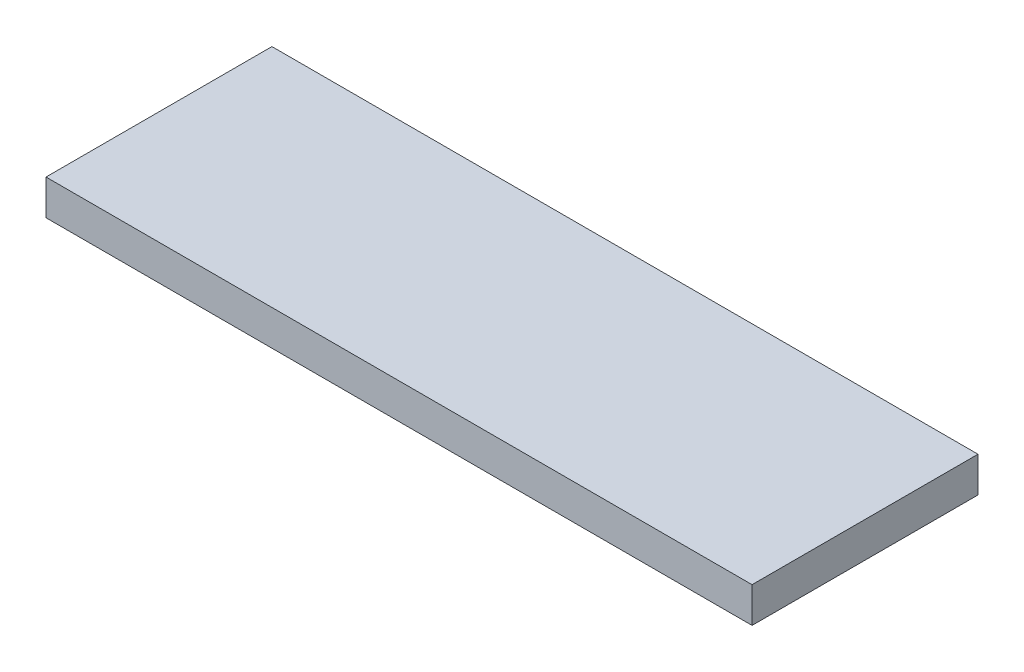
ISO-10303-21;
HEADER;
FILE_DESCRIPTION(('STEP AP214'),'2;1');
FILE_NAME('part.step','',(''),(''),'','','');
FILE_SCHEMA(('AUTOMOTIVE_DESIGN { 1 0 10303 214 1 1 1 1 }'));
ENDSEC;
DATA;
#1=APPLICATION_CONTEXT('core data for automotive mechanical design processes');
#2=APPLICATION_PROTOCOL_DEFINITION('international standard','automotive_design',2000,#1);
#3=PRODUCT_CONTEXT('',#1,'mechanical');
#4=PRODUCT('Part','Part','',(#3));
#5=PRODUCT_RELATED_PRODUCT_CATEGORY('part','',(#4));
#6=PRODUCT_DEFINITION_FORMATION('','',#4);
#7=PRODUCT_DEFINITION_CONTEXT('part definition',#1,'design');
#8=PRODUCT_DEFINITION('design','',#6,#7);
#9=PRODUCT_DEFINITION_SHAPE('','',#8);
#10=(LENGTH_UNIT() NAMED_UNIT(*) SI_UNIT(.MILLI.,.METRE.));
#11=(NAMED_UNIT(*) PLANE_ANGLE_UNIT() SI_UNIT($,.RADIAN.));
#12=(NAMED_UNIT(*) SI_UNIT($,.STERADIAN.) SOLID_ANGLE_UNIT());
#13=UNCERTAINTY_MEASURE_WITH_UNIT(LENGTH_MEASURE(1.E-05),#10,'distance_accuracy_value','');
#14=(GEOMETRIC_REPRESENTATION_CONTEXT(3) GLOBAL_UNCERTAINTY_ASSIGNED_CONTEXT((#13)) GLOBAL_UNIT_ASSIGNED_CONTEXT((#10,
#11,#12)) REPRESENTATION_CONTEXT('',''));
#15=CARTESIAN_POINT('',(0.,0.,0.));
#16=DIRECTION('',(0.,0.,1.));
#17=DIRECTION('',(1.,0.,0.));
#18=AXIS2_PLACEMENT_3D('',#15,#16,#17);
#19=CARTESIAN_POINT('',(50.,5.,16.));
#20=DIRECTION('',(-1.,0.,0.));
#21=DIRECTION('',(0.,0.,1.));
#22=AXIS2_PLACEMENT_3D('',#19,#20,#21);
#23=PLANE('',#22);
#24=DIRECTION('',(0.,0.,-1.));
#25=VECTOR('',#24,1.);
#26=CARTESIAN_POINT('',(50.,0.,16.));
#27=LINE('',#26,#25);
#28=CARTESIAN_POINT('',(50.,0.,16.));
#29=VERTEX_POINT('',#28);
#30=CARTESIAN_POINT('',(50.,0.,-16.));
#31=VERTEX_POINT('',#30);
#32=EDGE_CURVE('E111',#29,#31,#27,.T.);
#33=ORIENTED_EDGE('',*,*,#32,.T.);
#34=DIRECTION('',(0.,-1.,0.));
#35=VECTOR('',#34,1.);
#36=CARTESIAN_POINT('',(50.,5.,-16.));
#37=LINE('',#36,#35);
#38=CARTESIAN_POINT('',(50.,5.,-16.));
#39=VERTEX_POINT('',#38);
#40=EDGE_CURVE('E11',#39,#31,#37,.T.);
#41=ORIENTED_EDGE('',*,*,#40,.F.);
#42=DIRECTION('',(0.,0.,-1.));
#43=VECTOR('',#42,1.);
#44=CARTESIAN_POINT('',(50.,5.,16.));
#45=LINE('',#44,#43);
#46=CARTESIAN_POINT('',(50.,5.,16.));
#47=VERTEX_POINT('',#46);
#48=EDGE_CURVE('E95',#47,#39,#45,.T.);
#49=ORIENTED_EDGE('',*,*,#48,.F.);
#50=DIRECTION('',(0.,-1.,0.));
#51=VECTOR('',#50,1.);
#52=CARTESIAN_POINT('',(50.,5.,16.));
#53=LINE('',#52,#51);
#54=EDGE_CURVE('E107',#47,#29,#53,.T.);
#55=ORIENTED_EDGE('',*,*,#54,.T.);
#56=EDGE_LOOP('',(#33,#41,#49,#55));
#57=FACE_BOUND('',#56,.T.);
#58=ADVANCED_FACE('F43',(#57),#23,.F.);
#59=CARTESIAN_POINT('',(-50.,5.,-16.));
#60=DIRECTION('',(0.,0.,1.));
#61=DIRECTION('',(1.,0.,0.));
#62=AXIS2_PLACEMENT_3D('',#59,#60,#61);
#63=PLANE('',#62);
#64=DIRECTION('',(-1.,0.,0.));
#65=VECTOR('',#64,1.);
#66=CARTESIAN_POINT('',(-50.,0.,-16.));
#67=LINE('',#66,#65);
#68=CARTESIAN_POINT('',(-50.,0.,-16.));
#69=VERTEX_POINT('',#68);
#70=EDGE_CURVE('E100',#31,#69,#67,.T.);
#71=ORIENTED_EDGE('',*,*,#70,.T.);
#72=DIRECTION('',(0.,-1.,0.));
#73=VECTOR('',#72,1.);
#74=CARTESIAN_POINT('',(-50.,5.,-16.));
#75=LINE('',#74,#73);
#76=CARTESIAN_POINT('',(-50.,5.,-16.));
#77=VERTEX_POINT('',#76);
#78=EDGE_CURVE('E52',#77,#69,#75,.T.);
#79=ORIENTED_EDGE('',*,*,#78,.F.);
#80=DIRECTION('',(-1.,0.,0.));
#81=VECTOR('',#80,1.);
#82=CARTESIAN_POINT('',(-50.,5.,-16.));
#83=LINE('',#82,#81);
#84=EDGE_CURVE('E90',#39,#77,#83,.T.);
#85=ORIENTED_EDGE('',*,*,#84,.F.);
#86=ORIENTED_EDGE('',*,*,#40,.T.);
#87=EDGE_LOOP('',(#71,#79,#85,#86));
#88=FACE_BOUND('',#87,.T.);
#89=ADVANCED_FACE('F99',(#88),#63,.F.);
#90=CARTESIAN_POINT('',(-50.,5.,16.));
#91=DIRECTION('',(1.,0.,0.));
#92=DIRECTION('',(0.,0.,-1.));
#93=AXIS2_PLACEMENT_3D('',#90,#91,#92);
#94=PLANE('',#93);
#95=DIRECTION('',(0.,0.,1.));
#96=VECTOR('',#95,1.);
#97=CARTESIAN_POINT('',(-50.,0.,16.));
#98=LINE('',#97,#96);
#99=CARTESIAN_POINT('',(-50.,0.,16.));
#100=VERTEX_POINT('',#99);
#101=EDGE_CURVE('E77',#69,#100,#98,.T.);
#102=ORIENTED_EDGE('',*,*,#101,.T.);
#103=DIRECTION('',(0.,-1.,0.));
#104=VECTOR('',#103,1.);
#105=CARTESIAN_POINT('',(-50.,5.,16.));
#106=LINE('',#105,#104);
#107=CARTESIAN_POINT('',(-50.,5.,16.));
#108=VERTEX_POINT('',#107);
#109=EDGE_CURVE('E102',#108,#100,#106,.T.);
#110=ORIENTED_EDGE('',*,*,#109,.F.);
#111=DIRECTION('',(0.,0.,1.));
#112=VECTOR('',#111,1.);
#113=CARTESIAN_POINT('',(-50.,5.,16.));
#114=LINE('',#113,#112);
#115=EDGE_CURVE('E93',#77,#108,#114,.T.);
#116=ORIENTED_EDGE('',*,*,#115,.F.);
#117=ORIENTED_EDGE('',*,*,#78,.T.);
#118=EDGE_LOOP('',(#102,#110,#116,#117));
#119=FACE_BOUND('',#118,.T.);
#120=ADVANCED_FACE('F103',(#119),#94,.F.);
#121=CARTESIAN_POINT('',(-50.,5.,16.));
#122=DIRECTION('',(0.,0.,-1.));
#123=DIRECTION('',(-1.,0.,0.));
#124=AXIS2_PLACEMENT_3D('',#121,#122,#123);
#125=PLANE('',#124);
#126=DIRECTION('',(1.,0.,0.));
#127=VECTOR('',#126,1.);
#128=CARTESIAN_POINT('',(-50.,0.,16.));
#129=LINE('',#128,#127);
#130=EDGE_CURVE('E83',#100,#29,#129,.T.);
#131=ORIENTED_EDGE('',*,*,#130,.T.);
#132=ORIENTED_EDGE('',*,*,#54,.F.);
#133=DIRECTION('',(1.,0.,0.));
#134=VECTOR('',#133,1.);
#135=CARTESIAN_POINT('',(-50.,5.,16.));
#136=LINE('',#135,#134);
#137=EDGE_CURVE('E60',#108,#47,#136,.T.);
#138=ORIENTED_EDGE('',*,*,#137,.F.);
#139=ORIENTED_EDGE('',*,*,#109,.T.);
#140=EDGE_LOOP('',(#131,#132,#138,#139));
#141=FACE_BOUND('',#140,.T.);
#142=ADVANCED_FACE('F124',(#141),#125,.F.);
#143=CARTESIAN_POINT('',(0.,5.,0.));
#144=DIRECTION('',(0.,-1.,0.));
#145=DIRECTION('',(0.,0.,-1.));
#146=AXIS2_PLACEMENT_3D('',#143,#144,#145);
#147=PLANE('',#146);
#148=ORIENTED_EDGE('',*,*,#48,.T.);
#149=ORIENTED_EDGE('',*,*,#84,.T.);
#150=ORIENTED_EDGE('',*,*,#115,.T.);
#151=ORIENTED_EDGE('',*,*,#137,.T.);
#152=EDGE_LOOP('',(#148,#149,#150,#151));
#153=FACE_BOUND('',#152,.T.);
#154=ADVANCED_FACE('F91',(#153),#147,.F.);
#155=CARTESIAN_POINT('',(0.,0.,0.));
#156=DIRECTION('',(0.,-1.,0.));
#157=DIRECTION('',(0.,0.,-1.));
#158=AXIS2_PLACEMENT_3D('',#155,#156,#157);
#159=PLANE('',#158);
#160=ORIENTED_EDGE('',*,*,#32,.F.);
#161=ORIENTED_EDGE('',*,*,#130,.F.);
#162=ORIENTED_EDGE('',*,*,#101,.F.);
#163=ORIENTED_EDGE('',*,*,#70,.F.);
#164=EDGE_LOOP('',(#160,#161,#162,#163));
#165=FACE_BOUND('',#164,.T.);
#166=ADVANCED_FACE('F127',(#165),#159,.T.);
#167=CLOSED_SHELL('',(#58,#89,#120,#142,#154,#166));
#168=MANIFOLD_SOLID_BREP('B2',#167);
#169=ADVANCED_BREP_SHAPE_REPRESENTATION('',(#18,#168),#14);
#170=SHAPE_DEFINITION_REPRESENTATION(#9,#169);
ENDSEC;
END-ISO-10303-21;
